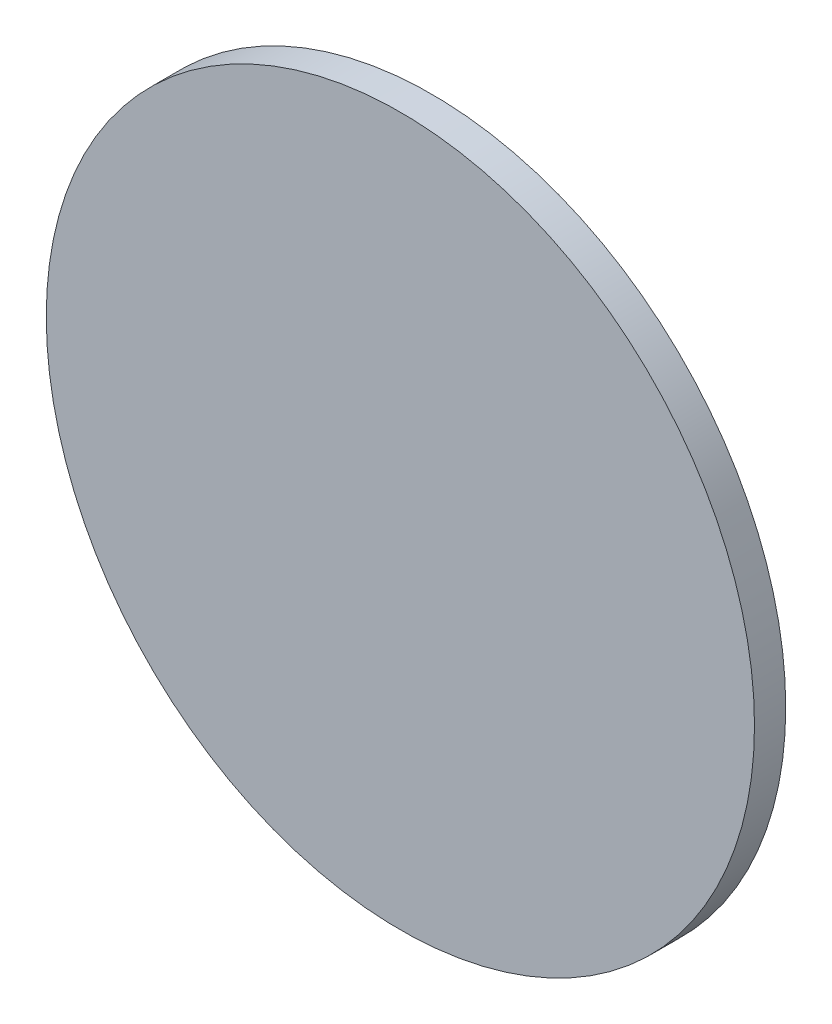
ISO-10303-21;
HEADER;
FILE_DESCRIPTION(('STEP AP214'),'2;1');
FILE_NAME('part.step','',(''),(''),'','','');
FILE_SCHEMA(('AUTOMOTIVE_DESIGN { 1 0 10303 214 1 1 1 1 }'));
ENDSEC;
DATA;
#1=APPLICATION_CONTEXT('core data for automotive mechanical design processes');
#2=APPLICATION_PROTOCOL_DEFINITION('international standard','automotive_design',2000,#1);
#3=PRODUCT_CONTEXT('',#1,'mechanical');
#4=PRODUCT('Part','Part','',(#3));
#5=PRODUCT_RELATED_PRODUCT_CATEGORY('part','',(#4));
#6=PRODUCT_DEFINITION_FORMATION('','',#4);
#7=PRODUCT_DEFINITION_CONTEXT('part definition',#1,'design');
#8=PRODUCT_DEFINITION('design','',#6,#7);
#9=PRODUCT_DEFINITION_SHAPE('','',#8);
#10=(LENGTH_UNIT() NAMED_UNIT(*) SI_UNIT(.MILLI.,.METRE.));
#11=(NAMED_UNIT(*) PLANE_ANGLE_UNIT() SI_UNIT($,.RADIAN.));
#12=(NAMED_UNIT(*) SI_UNIT($,.STERADIAN.) SOLID_ANGLE_UNIT());
#13=UNCERTAINTY_MEASURE_WITH_UNIT(LENGTH_MEASURE(1.E-05),#10,'distance_accuracy_value','');
#14=(GEOMETRIC_REPRESENTATION_CONTEXT(3) GLOBAL_UNCERTAINTY_ASSIGNED_CONTEXT((#13)) GLOBAL_UNIT_ASSIGNED_CONTEXT((#10,
#11,#12)) REPRESENTATION_CONTEXT('',''));
#15=CARTESIAN_POINT('',(0.,0.,0.));
#16=DIRECTION('',(0.,0.,1.));
#17=DIRECTION('',(1.,0.,0.));
#18=AXIS2_PLACEMENT_3D('',#15,#16,#17);
#19=CARTESIAN_POINT('',(0.,0.,7.5));
#20=DIRECTION('',(0.,0.,-1.));
#21=DIRECTION('',(-1.,0.,0.));
#22=AXIS2_PLACEMENT_3D('',#19,#20,#21);
#23=CYLINDRICAL_SURFACE('',#22,85.);
#24=CARTESIAN_POINT('',(0.,0.,7.5));
#25=DIRECTION('',(0.,0.,1.));
#26=DIRECTION('',(1.,0.,0.));
#27=AXIS2_PLACEMENT_3D('',#24,#25,#26);
#28=CIRCLE('',#27,85.);
#29=CARTESIAN_POINT('',(85.,0.,7.5));
#30=VERTEX_POINT('',#29);
#31=EDGE_CURVE('E11',#30,#30,#28,.T.);
#32=ORIENTED_EDGE('',*,*,#31,.F.);
#33=EDGE_LOOP('',(#32));
#34=FACE_BOUND('',#33,.T.);
#35=CARTESIAN_POINT('',(0.,0.,0.));
#36=DIRECTION('',(0.,0.,1.));
#37=DIRECTION('',(1.,0.,0.));
#38=AXIS2_PLACEMENT_3D('',#35,#36,#37);
#39=CIRCLE('',#38,85.);
#40=CARTESIAN_POINT('',(85.,0.,0.));
#41=VERTEX_POINT('',#40);
#42=EDGE_CURVE('E44',#41,#41,#39,.T.);
#43=ORIENTED_EDGE('',*,*,#42,.T.);
#44=EDGE_LOOP('',(#43));
#45=FACE_BOUND('',#44,.T.);
#46=ADVANCED_FACE('F36',(#34,#45),#23,.T.);
#47=CARTESIAN_POINT('',(0.,0.,7.5));
#48=DIRECTION('',(0.,0.,1.));
#49=DIRECTION('',(1.,0.,0.));
#50=AXIS2_PLACEMENT_3D('',#47,#48,#49);
#51=PLANE('',#50);
#52=ORIENTED_EDGE('',*,*,#31,.T.);
#53=EDGE_LOOP('',(#52));
#54=FACE_BOUND('',#53,.T.);
#55=ADVANCED_FACE('F231',(#54),#51,.T.);
#56=CARTESIAN_POINT('',(0.,0.,0.));
#57=DIRECTION('',(0.,0.,1.));
#58=DIRECTION('',(1.,0.,0.));
#59=AXIS2_PLACEMENT_3D('',#56,#57,#58);
#60=PLANE('',#59);
#61=CARTESIAN_POINT('',(0.,0.,0.));
#62=DIRECTION('',(0.,0.,1.));
#63=DIRECTION('',(1.,0.,0.));
#64=AXIS2_PLACEMENT_3D('',#61,#62,#63);
#65=CIRCLE('',#64,5.);
#66=CARTESIAN_POINT('',(5.,0.,0.));
#67=VERTEX_POINT('',#66);
#68=EDGE_CURVE('E39',#67,#67,#65,.T.);
#69=ORIENTED_EDGE('',*,*,#68,.T.);
#70=EDGE_LOOP('',(#69));
#71=FACE_BOUND('',#70,.T.);
#72=CARTESIAN_POINT('',(34.3385072436898,72.2832409364374,0.));
#73=DIRECTION('',(0.,0.,-1.));
#74=DIRECTION('',(0.451537642312314,0.892252070647659,0.));
#75=AXIS2_PLACEMENT_3D('',#72,#73,#74);
#76=CIRCLE('',#75,1.);
#77=CARTESIAN_POINT('',(33.8869696013775,71.3909888657898,0.));
#78=VERTEX_POINT('',#77);
#79=CARTESIAN_POINT('',(34.7900448860026,73.1754930070849,0.));
#80=VERTEX_POINT('',#79);
#81=EDGE_CURVE('E58',#78,#80,#76,.T.);
#82=ORIENTED_EDGE('',*,*,#81,.F.);
#83=DIRECTION('',(0.451537642312319,0.892252070647658,0.));
#84=VECTOR('',#83,1.);
#85=CARTESIAN_POINT('',(35.2415825283149,74.0677450777325,0.));
#86=LINE('',#85,#84);
#87=CARTESIAN_POINT('',(33.4354319590656,70.4987367951419,0.));
#88=VERTEX_POINT('',#87);
#89=EDGE_CURVE('E139',#88,#78,#86,.T.);
#90=ORIENTED_EDGE('',*,*,#89,.F.);
#91=DIRECTION('',(-0.892252070647657,0.45153764231232,0.));
#92=VECTOR('',#91,1.);
#93=CARTESIAN_POINT('',(37.0044402416562,68.6925862258927,0.));
#94=LINE('',#93,#92);
#95=CARTESIAN_POINT('',(37.0044402416562,68.6925862258927,0.));
#96=VERTEX_POINT('',#95);
#97=EDGE_CURVE('E167',#96,#88,#94,.T.);
#98=ORIENTED_EDGE('',*,*,#97,.F.);
#99=DIRECTION('',(0.451537642312319,0.892252070647658,0.));
#100=VECTOR('',#99,1.);
#101=CARTESIAN_POINT('',(38.8105908109055,72.2615945084833,0.));
#102=LINE('',#101,#100);
#103=CARTESIAN_POINT('',(37.4559778839686,69.5848382965403,0.));
#104=VERTEX_POINT('',#103);
#105=EDGE_CURVE('E189',#96,#104,#102,.T.);
#106=ORIENTED_EDGE('',*,*,#105,.T.);
#107=CARTESIAN_POINT('',(37.9075155262809,70.477090367188,0.));
#108=DIRECTION('',(0.,0.,1.));
#109=DIRECTION('',(0.451537642312319,0.892252070647657,0.));
#110=AXIS2_PLACEMENT_3D('',#107,#108,#109);
#111=CIRCLE('',#110,1.);
#112=CARTESIAN_POINT('',(38.3590531685932,71.3693424378356,0.));
#113=VERTEX_POINT('',#112);
#114=EDGE_CURVE('E467',#104,#113,#111,.T.);
#115=ORIENTED_EDGE('',*,*,#114,.T.);
#116=CARTESIAN_POINT('',(38.8105908109055,72.2615945084833,0.));
#117=VERTEX_POINT('',#116);
#118=EDGE_CURVE('E188',#113,#117,#102,.T.);
#119=ORIENTED_EDGE('',*,*,#118,.T.);
#120=DIRECTION('',(-0.892252070647657,0.45153764231232,0.));
#121=VECTOR('',#120,1.);
#122=CARTESIAN_POINT('',(38.8105908109055,72.2615945084833,0.));
#123=LINE('',#122,#121);
#124=CARTESIAN_POINT('',(35.2415825283149,74.0677450777325,0.));
#125=VERTEX_POINT('',#124);
#126=EDGE_CURVE('E192',#117,#125,#123,.T.);
#127=ORIENTED_EDGE('',*,*,#126,.T.);
#128=EDGE_CURVE('E141',#80,#125,#86,.T.);
#129=ORIENTED_EDGE('',*,*,#128,.F.);
#130=EDGE_LOOP('',(#82,#90,#98,#106,#115,#119,#127,#129));
#131=FACE_BOUND('',#130,.T.);
#132=CARTESIAN_POINT('',(-79.768376540671,-6.4036008671477,0.));
#133=DIRECTION('',(0.,0.,-1.));
#134=DIRECTION('',(-0.998481780916298,-0.0550829663164384,0.));
#135=AXIS2_PLACEMENT_3D('',#132,#133,#134);
#136=CIRCLE('',#135,1.);
#137=CARTESIAN_POINT('',(-78.7698947597547,-6.34851790083123,0.));
#138=VERTEX_POINT('',#137);
#139=CARTESIAN_POINT('',(-80.7668583215873,-6.45868383346369,0.));
#140=VERTEX_POINT('',#139);
#141=EDGE_CURVE('E142',#138,#140,#136,.T.);
#142=ORIENTED_EDGE('',*,*,#141,.F.);
#143=DIRECTION('',(-0.998481780916299,-0.0550829663164338,0.));
#144=VECTOR('',#143,1.);
#145=CARTESIAN_POINT('',(-81.7653401025036,-6.51376679978012,0.));
#146=LINE('',#145,#144);
#147=CARTESIAN_POINT('',(-77.7714129788384,-6.29343493451439,0.));
#148=VERTEX_POINT('',#147);
#149=EDGE_CURVE('E168',#148,#138,#146,.T.);
#150=ORIENTED_EDGE('',*,*,#149,.F.);
#151=DIRECTION('',(0.0550829663164331,-0.998481780916298,0.));
#152=VECTOR('',#151,1.);
#153=CARTESIAN_POINT('',(-77.9917448441042,-2.29950781084919,0.));
#154=LINE('',#153,#152);
#155=CARTESIAN_POINT('',(-77.9917448441042,-2.29950781084919,0.));
#156=VERTEX_POINT('',#155);
#157=EDGE_CURVE('E181',#156,#148,#154,.T.);
#158=ORIENTED_EDGE('',*,*,#157,.F.);
#159=DIRECTION('',(-0.998481780916299,-0.0550829663164338,0.));
#160=VECTOR('',#159,1.);
#161=CARTESIAN_POINT('',(-81.9856719677694,-2.51983967611493,0.));
#162=LINE('',#161,#160);
#163=CARTESIAN_POINT('',(-78.9902266250205,-2.35459077716563,0.));
#164=VERTEX_POINT('',#163);
#165=EDGE_CURVE('E175',#156,#164,#162,.T.);
#166=ORIENTED_EDGE('',*,*,#165,.T.);
#167=CARTESIAN_POINT('',(-79.9887084059368,-2.40967374348205,0.));
#168=DIRECTION('',(0.,0.,1.));
#169=DIRECTION('',(-0.998481780916298,-0.0550829663164333,0.));
#170=AXIS2_PLACEMENT_3D('',#167,#168,#169);
#171=CIRCLE('',#170,1.);
#172=CARTESIAN_POINT('',(-80.9871901868531,-2.46475670979848,0.));
#173=VERTEX_POINT('',#172);
#174=EDGE_CURVE('E474',#164,#173,#171,.T.);
#175=ORIENTED_EDGE('',*,*,#174,.T.);
#176=CARTESIAN_POINT('',(-81.9856719677694,-2.51983967611493,0.));
#177=VERTEX_POINT('',#176);
#178=EDGE_CURVE('E174',#173,#177,#162,.T.);
#179=ORIENTED_EDGE('',*,*,#178,.T.);
#180=DIRECTION('',(0.0550829663164331,-0.998481780916298,0.));
#181=VECTOR('',#180,1.);
#182=CARTESIAN_POINT('',(-81.9856719677694,-2.51983967611493,0.));
#183=LINE('',#182,#181);
#184=CARTESIAN_POINT('',(-81.7653401025036,-6.51376679978012,0.));
#185=VERTEX_POINT('',#184);
#186=EDGE_CURVE('E178',#177,#185,#183,.T.);
#187=ORIENTED_EDGE('',*,*,#186,.T.);
#188=EDGE_CURVE('E166',#140,#185,#146,.T.);
#189=ORIENTED_EDGE('',*,*,#188,.F.);
#190=EDGE_LOOP('',(#142,#150,#158,#166,#175,#179,#187,#189));
#191=FACE_BOUND('',#190,.T.);
#192=CARTESIAN_POINT('',(45.4298692969818,-65.8796400692896,0.));
#193=DIRECTION('',(0.,0.,-1.));
#194=DIRECTION('',(0.546944138603991,-0.83716910433122,0.));
#195=AXIS2_PLACEMENT_3D('',#192,#193,#194);
#196=CIRCLE('',#195,1.);
#197=CARTESIAN_POINT('',(44.8829251583778,-65.0424709649584,0.));
#198=VERTEX_POINT('',#197);
#199=CARTESIAN_POINT('',(45.9768134355854,-66.7168091736211,0.));
#200=VERTEX_POINT('',#199);
#201=EDGE_CURVE('E184',#198,#200,#196,.T.);
#202=ORIENTED_EDGE('',*,*,#201,.F.);
#203=DIRECTION('',(0.546944138603987,-0.837169104331223,0.));
#204=VECTOR('',#203,1.);
#205=CARTESIAN_POINT('',(46.5237575741894,-67.5539782779524,0.));
#206=LINE('',#205,#204);
#207=CARTESIAN_POINT('',(44.3359810197734,-64.2053018606275,0.));
#208=VERTEX_POINT('',#207);
#209=EDGE_CURVE('E210',#208,#198,#206,.T.);
#210=ORIENTED_EDGE('',*,*,#209,.F.);
#211=DIRECTION('',(0.837169104331223,0.546944138603987,0.));
#212=VECTOR('',#211,1.);
#213=CARTESIAN_POINT('',(40.9873046024485,-66.3930784150434,0.));
#214=LINE('',#213,#212);
#215=CARTESIAN_POINT('',(40.9873046024485,-66.3930784150434,0.));
#216=VERTEX_POINT('',#215);
#217=EDGE_CURVE('E223',#216,#208,#214,.T.);
#218=ORIENTED_EDGE('',*,*,#217,.F.);
#219=DIRECTION('',(0.546944138603987,-0.837169104331223,0.));
#220=VECTOR('',#219,1.);
#221=CARTESIAN_POINT('',(43.1750811568645,-69.7417548323683,0.));
#222=LINE('',#221,#220);
#223=CARTESIAN_POINT('',(41.5342487410525,-67.2302475193746,0.));
#224=VERTEX_POINT('',#223);
#225=EDGE_CURVE('E217',#216,#224,#222,.T.);
#226=ORIENTED_EDGE('',*,*,#225,.T.);
#227=CARTESIAN_POINT('',(42.0811928796565,-68.0674166237059,0.));
#228=DIRECTION('',(0.,0.,1.));
#229=DIRECTION('',(0.546944138603987,-0.837169104331223,0.));
#230=AXIS2_PLACEMENT_3D('',#227,#228,#229);
#231=CIRCLE('',#230,1.);
#232=CARTESIAN_POINT('',(42.6281370182605,-68.9045857280371,0.));
#233=VERTEX_POINT('',#232);
#234=EDGE_CURVE('E196',#224,#233,#231,.T.);
#235=ORIENTED_EDGE('',*,*,#234,.T.);
#236=CARTESIAN_POINT('',(43.1750811568645,-69.7417548323683,0.));
#237=VERTEX_POINT('',#236);
#238=EDGE_CURVE('E216',#233,#237,#222,.T.);
#239=ORIENTED_EDGE('',*,*,#238,.T.);
#240=DIRECTION('',(0.837169104331223,0.546944138603987,0.));
#241=VECTOR('',#240,1.);
#242=CARTESIAN_POINT('',(43.1750811568645,-69.7417548323683,0.));
#243=LINE('',#242,#241);
#244=CARTESIAN_POINT('',(46.5237575741894,-67.5539782779524,0.));
#245=VERTEX_POINT('',#244);
#246=EDGE_CURVE('E220',#237,#245,#243,.T.);
#247=ORIENTED_EDGE('',*,*,#246,.T.);
#248=EDGE_CURVE('E209',#200,#245,#206,.T.);
#249=ORIENTED_EDGE('',*,*,#248,.F.);
#250=EDGE_LOOP('',(#202,#210,#218,#226,#235,#239,#247,#249));
#251=FACE_BOUND('',#250,.T.);
#252=ORIENTED_EDGE('',*,*,#42,.F.);
#253=EDGE_LOOP('',(#252));
#254=FACE_BOUND('',#253,.T.);
#255=ADVANCED_FACE('F136',(#71,#131,#191,#251,#254),#60,.F.);
#256=CARTESIAN_POINT('',(42.0811928796565,-68.0674166237059,0.));
#257=DIRECTION('',(0.837169104331223,0.546944138603987,0.));
#258=DIRECTION('',(-0.546944138603987,0.837169104331223,0.));
#259=AXIS2_PLACEMENT_3D('',#256,#257,#258);
#260=CYLINDRICAL_SURFACE('',#259,1.99999999999999);
#261=ORIENTED_EDGE('',*,*,#246,.F.);
#262=CARTESIAN_POINT('',(42.0811928796565,-68.0674166237059,0.));
#263=DIRECTION('',(-0.837169104331223,-0.546944138603987,0.));
#264=DIRECTION('',(0.546944138603987,-0.837169104331223,0.));
#265=AXIS2_PLACEMENT_3D('',#262,#263,#264);
#266=CIRCLE('',#265,1.99999999999999);
#267=EDGE_CURVE('E213',#237,#216,#266,.T.);
#268=ORIENTED_EDGE('',*,*,#267,.T.);
#269=ORIENTED_EDGE('',*,*,#217,.T.);
#270=CARTESIAN_POINT('',(45.4298692969814,-65.8796400692899,0.));
#271=DIRECTION('',(-0.837169104331223,-0.546944138603987,0.));
#272=DIRECTION('',(0.546944138603987,-0.837169104331223,0.));
#273=AXIS2_PLACEMENT_3D('',#270,#271,#272);
#274=CIRCLE('',#273,1.99999999999999);
#275=EDGE_CURVE('E207',#245,#208,#274,.T.);
#276=ORIENTED_EDGE('',*,*,#275,.F.);
#277=EDGE_LOOP('',(#261,#268,#269,#276));
#278=FACE_BOUND('',#277,.T.);
#279=ADVANCED_FACE('F230',(#278),#260,.F.);
#280=CARTESIAN_POINT('',(42.0811928796565,-68.0674166237059,0.));
#281=DIRECTION('',(-0.837169104331223,-0.546944138603987,0.));
#282=DIRECTION('',(0.546944138603987,-0.837169104331223,0.));
#283=AXIS2_PLACEMENT_3D('',#280,#281,#282);
#284=PLANE('',#283);
#285=ORIENTED_EDGE('',*,*,#238,.F.);
#286=CARTESIAN_POINT('',(42.0811928796565,-68.0674166237059,0.));
#287=DIRECTION('',(-0.837169104331223,-0.546944138603987,0.));
#288=DIRECTION('',(0.546944138603987,-0.837169104331223,0.));
#289=AXIS2_PLACEMENT_3D('',#286,#287,#288);
#290=CIRCLE('',#289,1.);
#291=EDGE_CURVE('E200',#233,#224,#290,.T.);
#292=ORIENTED_EDGE('',*,*,#291,.T.);
#293=ORIENTED_EDGE('',*,*,#225,.F.);
#294=ORIENTED_EDGE('',*,*,#267,.F.);
#295=EDGE_LOOP('',(#285,#292,#293,#294));
#296=FACE_BOUND('',#295,.T.);
#297=ADVANCED_FACE('F237',(#296),#284,.F.);
#298=CARTESIAN_POINT('',(45.4298692969814,-65.8796400692899,0.));
#299=DIRECTION('',(-0.837169104331223,-0.546944138603987,0.));
#300=DIRECTION('',(0.546944138603987,-0.837169104331223,0.));
#301=AXIS2_PLACEMENT_3D('',#298,#299,#300);
#302=PLANE('',#301);
#303=CARTESIAN_POINT('',(45.4298692969814,-65.8796400692899,0.));
#304=DIRECTION('',(-0.837169104331223,-0.546944138603987,0.));
#305=DIRECTION('',(0.546944138603987,-0.837169104331223,0.));
#306=AXIS2_PLACEMENT_3D('',#303,#304,#305);
#307=CIRCLE('',#306,1.);
#308=EDGE_CURVE('E204',#200,#198,#307,.T.);
#309=ORIENTED_EDGE('',*,*,#308,.F.);
#310=ORIENTED_EDGE('',*,*,#248,.T.);
#311=ORIENTED_EDGE('',*,*,#275,.T.);
#312=ORIENTED_EDGE('',*,*,#209,.T.);
#313=EDGE_LOOP('',(#309,#310,#311,#312));
#314=FACE_BOUND('',#313,.T.);
#315=ADVANCED_FACE('F268',(#314),#302,.T.);
#316=CARTESIAN_POINT('',(45.4298692969814,-65.8796400692899,0.));
#317=DIRECTION('',(-0.837169104331223,-0.546944138603987,0.));
#318=DIRECTION('',(0.546944138603987,-0.837169104331223,0.));
#319=AXIS2_PLACEMENT_3D('',#316,#317,#318);
#320=CYLINDRICAL_SURFACE('',#319,1.);
#321=ORIENTED_EDGE('',*,*,#308,.T.);
#322=EDGE_CURVE('E203',#198,#200,#307,.T.);
#323=ORIENTED_EDGE('',*,*,#322,.T.);
#324=EDGE_LOOP('',(#321,#323));
#325=FACE_BOUND('',#324,.T.);
#326=ORIENTED_EDGE('',*,*,#291,.F.);
#327=EDGE_CURVE('E199',#224,#233,#290,.T.);
#328=ORIENTED_EDGE('',*,*,#327,.F.);
#329=EDGE_LOOP('',(#326,#328));
#330=FACE_BOUND('',#329,.T.);
#331=ADVANCED_FACE('F282',(#325,#330),#320,.T.);
#332=CARTESIAN_POINT('',(42.0811928796565,-68.0674166237059,0.));
#333=DIRECTION('',(0.546944138603987,-0.837169104331223,0.));
#334=DIRECTION('',(0.837169104331223,0.546944138603987,0.));
#335=AXIS2_PLACEMENT_3D('',#332,#333,#334);
#336=SPHERICAL_SURFACE('',#335,1.);
#337=ORIENTED_EDGE('',*,*,#327,.T.);
#338=ORIENTED_EDGE('',*,*,#234,.F.);
#339=EDGE_LOOP('',(#337,#338));
#340=FACE_BOUND('',#339,.T.);
#341=ADVANCED_FACE('F276',(#340),#336,.T.);
#342=CARTESIAN_POINT('',(45.4298692969818,-65.8796400692896,0.));
#343=DIRECTION('',(0.546944138603991,-0.83716910433122,0.));
#344=DIRECTION('',(-0.837169104331221,-0.546944138603991,0.));
#345=AXIS2_PLACEMENT_3D('',#342,#343,#344);
#346=SPHERICAL_SURFACE('',#345,1.);
#347=ORIENTED_EDGE('',*,*,#322,.F.);
#348=ORIENTED_EDGE('',*,*,#201,.T.);
#349=EDGE_LOOP('',(#347,#348));
#350=FACE_BOUND('',#349,.T.);
#351=ADVANCED_FACE('F281',(#350),#346,.T.);
#352=CARTESIAN_POINT('',(37.9075155262809,70.477090367188,0.));
#353=DIRECTION('',(-0.892252070647657,0.45153764231232,0.));
#354=DIRECTION('',(-0.45153764231232,-0.892252070647657,0.));
#355=AXIS2_PLACEMENT_3D('',#352,#353,#354);
#356=CYLINDRICAL_SURFACE('',#355,1.99999999999999);
#357=ORIENTED_EDGE('',*,*,#126,.F.);
#358=CARTESIAN_POINT('',(37.9075155262809,70.477090367188,0.));
#359=DIRECTION('',(0.892252070647657,-0.45153764231232,0.));
#360=DIRECTION('',(0.45153764231232,0.892252070647657,0.));
#361=AXIS2_PLACEMENT_3D('',#358,#359,#360);
#362=CIRCLE('',#361,1.99999999999999);
#363=EDGE_CURVE('E149',#117,#96,#362,.T.);
#364=ORIENTED_EDGE('',*,*,#363,.T.);
#365=ORIENTED_EDGE('',*,*,#97,.T.);
#366=CARTESIAN_POINT('',(34.3385072436903,72.2832409364372,0.));
#367=DIRECTION('',(0.892252070647657,-0.45153764231232,0.));
#368=DIRECTION('',(0.45153764231232,0.892252070647657,0.));
#369=AXIS2_PLACEMENT_3D('',#366,#367,#368);
#370=CIRCLE('',#369,1.99999999999999);
#371=EDGE_CURVE('E147',#125,#88,#370,.T.);
#372=ORIENTED_EDGE('',*,*,#371,.F.);
#373=EDGE_LOOP('',(#357,#364,#365,#372));
#374=FACE_BOUND('',#373,.T.);
#375=ADVANCED_FACE('F311',(#374),#356,.F.);
#376=CARTESIAN_POINT('',(37.9075155262809,70.477090367188,0.));
#377=DIRECTION('',(0.892252070647657,-0.45153764231232,0.));
#378=DIRECTION('',(0.45153764231232,0.892252070647657,0.));
#379=AXIS2_PLACEMENT_3D('',#376,#377,#378);
#380=PLANE('',#379);
#381=ORIENTED_EDGE('',*,*,#118,.F.);
#382=CARTESIAN_POINT('',(37.9075155262809,70.477090367188,0.));
#383=DIRECTION('',(0.892252070647657,-0.45153764231232,0.));
#384=DIRECTION('',(0.45153764231232,0.892252070647657,0.));
#385=AXIS2_PLACEMENT_3D('',#382,#383,#384);
#386=CIRCLE('',#385,1.);
#387=EDGE_CURVE('E130',#113,#104,#386,.T.);
#388=ORIENTED_EDGE('',*,*,#387,.T.);
#389=ORIENTED_EDGE('',*,*,#105,.F.);
#390=ORIENTED_EDGE('',*,*,#363,.F.);
#391=EDGE_LOOP('',(#381,#388,#389,#390));
#392=FACE_BOUND('',#391,.T.);
#393=ADVANCED_FACE('F322',(#392),#380,.F.);
#394=CARTESIAN_POINT('',(34.3385072436903,72.2832409364372,0.));
#395=DIRECTION('',(0.892252070647657,-0.45153764231232,0.));
#396=DIRECTION('',(0.45153764231232,0.892252070647657,0.));
#397=AXIS2_PLACEMENT_3D('',#394,#395,#396);
#398=PLANE('',#397);
#399=CARTESIAN_POINT('',(34.3385072436903,72.2832409364372,0.));
#400=DIRECTION('',(0.892252070647657,-0.45153764231232,0.));
#401=DIRECTION('',(0.45153764231232,0.892252070647657,0.));
#402=AXIS2_PLACEMENT_3D('',#399,#400,#401);
#403=CIRCLE('',#402,1.);
#404=EDGE_CURVE('E129',#80,#78,#403,.T.);
#405=ORIENTED_EDGE('',*,*,#404,.F.);
#406=ORIENTED_EDGE('',*,*,#128,.T.);
#407=ORIENTED_EDGE('',*,*,#371,.T.);
#408=ORIENTED_EDGE('',*,*,#89,.T.);
#409=EDGE_LOOP('',(#405,#406,#407,#408));
#410=FACE_BOUND('',#409,.T.);
#411=ADVANCED_FACE('F145',(#410),#398,.T.);
#412=CARTESIAN_POINT('',(-79.9887084059368,-2.40967374348206,0.));
#413=DIRECTION('',(0.0550829663164331,-0.998481780916298,0.));
#414=DIRECTION('',(0.998481780916298,0.0550829663164331,0.));
#415=AXIS2_PLACEMENT_3D('',#412,#413,#414);
#416=CYLINDRICAL_SURFACE('',#415,1.99999999999999);
#417=ORIENTED_EDGE('',*,*,#186,.F.);
#418=CARTESIAN_POINT('',(-79.9887084059368,-2.40967374348206,0.));
#419=DIRECTION('',(-0.0550829663164331,0.998481780916298,0.));
#420=DIRECTION('',(-0.998481780916298,-0.0550829663164331,0.));
#421=AXIS2_PLACEMENT_3D('',#418,#419,#420);
#422=CIRCLE('',#421,1.99999999999999);
#423=EDGE_CURVE('E171',#177,#156,#422,.T.);
#424=ORIENTED_EDGE('',*,*,#423,.T.);
#425=ORIENTED_EDGE('',*,*,#157,.T.);
#426=CARTESIAN_POINT('',(-79.768376540671,-6.40360086714726,0.));
#427=DIRECTION('',(-0.0550829663164331,0.998481780916298,0.));
#428=DIRECTION('',(-0.998481780916298,-0.0550829663164331,0.));
#429=AXIS2_PLACEMENT_3D('',#426,#427,#428);
#430=CIRCLE('',#429,1.99999999999999);
#431=EDGE_CURVE('E164',#185,#148,#430,.T.);
#432=ORIENTED_EDGE('',*,*,#431,.F.);
#433=EDGE_LOOP('',(#417,#424,#425,#432));
#434=FACE_BOUND('',#433,.T.);
#435=ADVANCED_FACE('F341',(#434),#416,.F.);
#436=CARTESIAN_POINT('',(-79.9887084059368,-2.40967374348206,0.));
#437=DIRECTION('',(-0.0550829663164331,0.998481780916298,0.));
#438=DIRECTION('',(-0.998481780916298,-0.0550829663164331,0.));
#439=AXIS2_PLACEMENT_3D('',#436,#437,#438);
#440=PLANE('',#439);
#441=ORIENTED_EDGE('',*,*,#178,.F.);
#442=CARTESIAN_POINT('',(-79.9887084059368,-2.40967374348206,0.));
#443=DIRECTION('',(-0.0550829663164331,0.998481780916298,0.));
#444=DIRECTION('',(-0.998481780916298,-0.0550829663164331,0.));
#445=AXIS2_PLACEMENT_3D('',#442,#443,#444);
#446=CIRCLE('',#445,1.);
#447=EDGE_CURVE('E154',#173,#164,#446,.T.);
#448=ORIENTED_EDGE('',*,*,#447,.T.);
#449=ORIENTED_EDGE('',*,*,#165,.F.);
#450=ORIENTED_EDGE('',*,*,#423,.F.);
#451=EDGE_LOOP('',(#441,#448,#449,#450));
#452=FACE_BOUND('',#451,.T.);
#453=ADVANCED_FACE('F350',(#452),#440,.F.);
#454=CARTESIAN_POINT('',(-79.768376540671,-6.40360086714726,0.));
#455=DIRECTION('',(-0.0550829663164331,0.998481780916298,0.));
#456=DIRECTION('',(-0.998481780916298,-0.0550829663164331,0.));
#457=AXIS2_PLACEMENT_3D('',#454,#455,#456);
#458=PLANE('',#457);
#459=CARTESIAN_POINT('',(-79.768376540671,-6.40360086714726,0.));
#460=DIRECTION('',(-0.0550829663164331,0.998481780916298,0.));
#461=DIRECTION('',(-0.998481780916298,-0.0550829663164331,0.));
#462=AXIS2_PLACEMENT_3D('',#459,#460,#461);
#463=CIRCLE('',#462,1.);
#464=EDGE_CURVE('E161',#140,#138,#463,.T.);
#465=ORIENTED_EDGE('',*,*,#464,.F.);
#466=ORIENTED_EDGE('',*,*,#188,.T.);
#467=ORIENTED_EDGE('',*,*,#431,.T.);
#468=ORIENTED_EDGE('',*,*,#149,.T.);
#469=EDGE_LOOP('',(#465,#466,#467,#468));
#470=FACE_BOUND('',#469,.T.);
#471=ADVANCED_FACE('F360',(#470),#458,.T.);
#472=CARTESIAN_POINT('',(-79.768376540671,-6.40360086714726,0.));
#473=DIRECTION('',(-0.0550829663164331,0.998481780916298,0.));
#474=DIRECTION('',(-0.998481780916298,-0.0550829663164331,0.));
#475=AXIS2_PLACEMENT_3D('',#472,#473,#474);
#476=CYLINDRICAL_SURFACE('',#475,1.);
#477=ORIENTED_EDGE('',*,*,#464,.T.);
#478=EDGE_CURVE('E160',#138,#140,#463,.T.);
#479=ORIENTED_EDGE('',*,*,#478,.T.);
#480=EDGE_LOOP('',(#477,#479));
#481=FACE_BOUND('',#480,.T.);
#482=ORIENTED_EDGE('',*,*,#447,.F.);
#483=EDGE_CURVE('E152',#164,#173,#446,.T.);
#484=ORIENTED_EDGE('',*,*,#483,.F.);
#485=EDGE_LOOP('',(#482,#484));
#486=FACE_BOUND('',#485,.T.);
#487=ADVANCED_FACE('F370',(#481,#486),#476,.T.);
#488=CARTESIAN_POINT('',(34.3385072436903,72.2832409364372,0.));
#489=DIRECTION('',(0.892252070647657,-0.45153764231232,0.));
#490=DIRECTION('',(0.45153764231232,0.892252070647657,0.));
#491=AXIS2_PLACEMENT_3D('',#488,#489,#490);
#492=CYLINDRICAL_SURFACE('',#491,1.);
#493=ORIENTED_EDGE('',*,*,#404,.T.);
#494=EDGE_CURVE('E125',#78,#80,#403,.T.);
#495=ORIENTED_EDGE('',*,*,#494,.T.);
#496=EDGE_LOOP('',(#493,#495));
#497=FACE_BOUND('',#496,.T.);
#498=ORIENTED_EDGE('',*,*,#387,.F.);
#499=EDGE_CURVE('E51',#104,#113,#386,.T.);
#500=ORIENTED_EDGE('',*,*,#499,.F.);
#501=EDGE_LOOP('',(#498,#500));
#502=FACE_BOUND('',#501,.T.);
#503=ADVANCED_FACE('F151',(#497,#502),#492,.T.);
#504=CARTESIAN_POINT('',(-79.9887084059368,-2.40967374348205,0.));
#505=DIRECTION('',(-0.998481780916298,-0.0550829663164333,0.));
#506=DIRECTION('',(0.0550829663164333,-0.998481780916298,0.));
#507=AXIS2_PLACEMENT_3D('',#504,#505,#506);
#508=SPHERICAL_SURFACE('',#507,1.);
#509=ORIENTED_EDGE('',*,*,#483,.T.);
#510=ORIENTED_EDGE('',*,*,#174,.F.);
#511=EDGE_LOOP('',(#509,#510));
#512=FACE_BOUND('',#511,.T.);
#513=ADVANCED_FACE('F389',(#512),#508,.T.);
#514=CARTESIAN_POINT('',(37.9075155262809,70.477090367188,0.));
#515=DIRECTION('',(0.451537642312319,0.892252070647657,0.));
#516=DIRECTION('',(-0.892252070647657,0.451537642312319,0.));
#517=AXIS2_PLACEMENT_3D('',#514,#515,#516);
#518=SPHERICAL_SURFACE('',#517,1.);
#519=ORIENTED_EDGE('',*,*,#499,.T.);
#520=ORIENTED_EDGE('',*,*,#114,.F.);
#521=EDGE_LOOP('',(#519,#520));
#522=FACE_BOUND('',#521,.T.);
#523=ADVANCED_FACE('F399',(#522),#518,.T.);
#524=CARTESIAN_POINT('',(-79.768376540671,-6.4036008671477,0.));
#525=DIRECTION('',(-0.998481780916298,-0.0550829663164384,0.));
#526=DIRECTION('',(-0.0550829663164384,0.998481780916298,0.));
#527=AXIS2_PLACEMENT_3D('',#524,#525,#526);
#528=SPHERICAL_SURFACE('',#527,1.);
#529=ORIENTED_EDGE('',*,*,#478,.F.);
#530=ORIENTED_EDGE('',*,*,#141,.T.);
#531=EDGE_LOOP('',(#529,#530));
#532=FACE_BOUND('',#531,.T.);
#533=ADVANCED_FACE('F411',(#532),#528,.T.);
#534=CARTESIAN_POINT('',(34.3385072436898,72.2832409364374,0.));
#535=DIRECTION('',(0.451537642312314,0.892252070647659,0.));
#536=DIRECTION('',(0.89225207064766,-0.451537642312315,0.));
#537=AXIS2_PLACEMENT_3D('',#534,#535,#536);
#538=SPHERICAL_SURFACE('',#537,1.);
#539=ORIENTED_EDGE('',*,*,#494,.F.);
#540=ORIENTED_EDGE('',*,*,#81,.T.);
#541=EDGE_LOOP('',(#539,#540));
#542=FACE_BOUND('',#541,.T.);
#543=ADVANCED_FACE('F126',(#542),#538,.T.);
#544=CARTESIAN_POINT('',(0.,0.,0.));
#545=DIRECTION('',(0.,0.,-1.));
#546=DIRECTION('',(0.,-1.,0.));
#547=AXIS2_PLACEMENT_3D('',#544,#545,#546);
#548=SPHERICAL_SURFACE('',#547,5.);
#549=ORIENTED_EDGE('',*,*,#68,.F.);
#550=EDGE_LOOP('',(#549));
#551=FACE_BOUND('',#550,.T.);
#552=ADVANCED_FACE('F433',(#551),#548,.F.);
#553=CLOSED_SHELL('',(#46,#55,#255,#279,#297,#315,#331,#341,#351,#375,#393,#411,#435,#453,#471,
#487,#503,#513,#523,#533,#543,#552));
#554=MANIFOLD_SOLID_BREP('B2',#553);
#555=ADVANCED_BREP_SHAPE_REPRESENTATION('',(#18,#554),#14);
#556=SHAPE_DEFINITION_REPRESENTATION(#9,#555);
ENDSEC;
END-ISO-10303-21;
